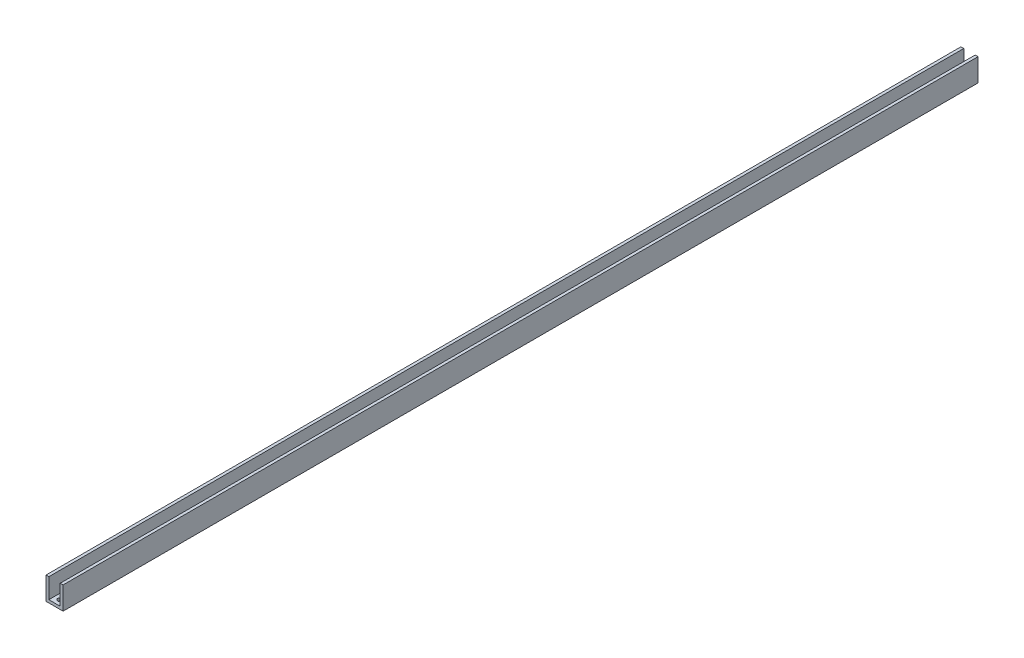
ISO-10303-21;
HEADER;
FILE_DESCRIPTION(('STEP AP214'),'2;1');
FILE_NAME('part.step','',(''),(''),'','','');
FILE_SCHEMA(('AUTOMOTIVE_DESIGN { 1 0 10303 214 1 1 1 1 }'));
ENDSEC;
DATA;
#1=APPLICATION_CONTEXT('core data for automotive mechanical design processes');
#2=APPLICATION_PROTOCOL_DEFINITION('international standard','automotive_design',2000,#1);
#3=PRODUCT_CONTEXT('',#1,'mechanical');
#4=PRODUCT('Part','Part','',(#3));
#5=PRODUCT_RELATED_PRODUCT_CATEGORY('part','',(#4));
#6=PRODUCT_DEFINITION_FORMATION('','',#4);
#7=PRODUCT_DEFINITION_CONTEXT('part definition',#1,'design');
#8=PRODUCT_DEFINITION('design','',#6,#7);
#9=PRODUCT_DEFINITION_SHAPE('','',#8);
#10=(LENGTH_UNIT() NAMED_UNIT(*) SI_UNIT(.MILLI.,.METRE.));
#11=(NAMED_UNIT(*) PLANE_ANGLE_UNIT() SI_UNIT($,.RADIAN.));
#12=(NAMED_UNIT(*) SI_UNIT($,.STERADIAN.) SOLID_ANGLE_UNIT());
#13=UNCERTAINTY_MEASURE_WITH_UNIT(LENGTH_MEASURE(1.E-05),#10,'distance_accuracy_value','');
#14=(GEOMETRIC_REPRESENTATION_CONTEXT(3) GLOBAL_UNCERTAINTY_ASSIGNED_CONTEXT((#13)) GLOBAL_UNIT_ASSIGNED_CONTEXT((#10,
#11,#12)) REPRESENTATION_CONTEXT('',''));
#15=CARTESIAN_POINT('',(0.,0.,0.));
#16=DIRECTION('',(0.,0.,1.));
#17=DIRECTION('',(1.,0.,0.));
#18=AXIS2_PLACEMENT_3D('',#15,#16,#17);
#19=CARTESIAN_POINT('',(9.525000000375,25.4000000003,510.));
#20=DIRECTION('',(3.1496021879254E-11,-1.,0.));
#21=DIRECTION('',(1.,3.1496021879254E-11,0.));
#22=AXIS2_PLACEMENT_3D('',#19,#20,#21);
#23=PLANE('',#22);
#24=DIRECTION('',(-1.,-3.1496021879254E-11,0.));
#25=VECTOR('',#24,1.);
#26=CARTESIAN_POINT('',(9.525000000375,25.4000000003,-510.));
#27=LINE('',#26,#25);
#28=CARTESIAN_POINT('',(9.525000000375,25.4000000003,-510.));
#29=VERTEX_POINT('',#28);
#30=CARTESIAN_POINT('',(6.3499999994375,25.4000000002,-510.));
#31=VERTEX_POINT('',#30);
#32=EDGE_CURVE('E180',#29,#31,#27,.T.);
#33=ORIENTED_EDGE('',*,*,#32,.T.);
#34=DIRECTION('',(0.,0.,-1.));
#35=VECTOR('',#34,1.);
#36=CARTESIAN_POINT('',(6.3499999994375,25.4000000002,510.));
#37=LINE('',#36,#35);
#38=CARTESIAN_POINT('',(6.3499999994375,25.4000000002,510.));
#39=VERTEX_POINT('',#38);
#40=EDGE_CURVE('E13',#39,#31,#37,.T.);
#41=ORIENTED_EDGE('',*,*,#40,.F.);
#42=DIRECTION('',(-1.,-3.1496021879254E-11,0.));
#43=VECTOR('',#42,1.);
#44=CARTESIAN_POINT('',(9.525000000375,25.4000000003,510.));
#45=LINE('',#44,#43);
#46=CARTESIAN_POINT('',(9.525000000375,25.4000000003,510.));
#47=VERTEX_POINT('',#46);
#48=EDGE_CURVE('E203',#47,#39,#45,.T.);
#49=ORIENTED_EDGE('',*,*,#48,.F.);
#50=DIRECTION('',(0.,0.,-1.));
#51=VECTOR('',#50,1.);
#52=CARTESIAN_POINT('',(9.525000000375,25.4000000003,510.));
#53=LINE('',#52,#51);
#54=EDGE_CURVE('E176',#47,#29,#53,.T.);
#55=ORIENTED_EDGE('',*,*,#54,.T.);
#56=EDGE_LOOP('',(#33,#41,#49,#55));
#57=FACE_BOUND('',#56,.T.);
#58=ADVANCED_FACE('F62',(#57),#23,.F.);
#59=CARTESIAN_POINT('',(6.3499999994375,25.4000000002,510.));
#60=DIRECTION('',(1.,1.6872907895327E-11,0.));
#61=DIRECTION('',(-1.6872907895327E-11,1.,0.));
#62=AXIS2_PLACEMENT_3D('',#59,#60,#61);
#63=PLANE('',#62);
#64=DIRECTION('',(1.6872907895327E-11,-1.,0.));
#65=VECTOR('',#64,1.);
#66=CARTESIAN_POINT('',(6.3499999994375,25.4000000002,-510.));
#67=LINE('',#66,#65);
#68=CARTESIAN_POINT('',(6.3499999998125,3.1750000002775,-510.));
#69=VERTEX_POINT('',#68);
#70=EDGE_CURVE('E184',#31,#69,#67,.T.);
#71=ORIENTED_EDGE('',*,*,#70,.T.);
#72=DIRECTION('',(0.,0.,-1.));
#73=VECTOR('',#72,1.);
#74=CARTESIAN_POINT('',(6.3499999998125,3.1750000002775,510.));
#75=LINE('',#74,#73);
#76=CARTESIAN_POINT('',(6.3499999998125,3.1750000002775,510.));
#77=VERTEX_POINT('',#76);
#78=EDGE_CURVE('E71',#77,#69,#75,.T.);
#79=ORIENTED_EDGE('',*,*,#78,.F.);
#80=DIRECTION('',(1.6872907895327E-11,-1.,0.));
#81=VECTOR('',#80,1.);
#82=CARTESIAN_POINT('',(6.3499999994375,25.4000000002,510.));
#83=LINE('',#82,#81);
#84=EDGE_CURVE('E134',#39,#77,#83,.T.);
#85=ORIENTED_EDGE('',*,*,#84,.F.);
#86=ORIENTED_EDGE('',*,*,#40,.T.);
#87=EDGE_LOOP('',(#71,#79,#85,#86));
#88=FACE_BOUND('',#87,.T.);
#89=ADVANCED_FACE('F293',(#88),#63,.F.);
#90=CARTESIAN_POINT('',(6.3499999998125,3.1750000002775,510.));
#91=DIRECTION('',(2.18504129928468E-11,-1.,0.));
#92=DIRECTION('',(1.,2.18504129928468E-11,0.));
#93=AXIS2_PLACEMENT_3D('',#90,#91,#92);
#94=PLANE('',#93);
#95=CARTESIAN_POINT('',(-3.10419892534837E-11,3.17500000013875,-490.95));
#96=DIRECTION('',(2.18504129928468E-11,-1.,0.));
#97=DIRECTION('',(1.,2.18504129928468E-11,0.));
#98=AXIS2_PLACEMENT_3D('',#95,#96,#97);
#99=CIRCLE('',#98,2.74999999999999);
#100=CARTESIAN_POINT('',(2.74999999996895,3.17500000019884,-490.95));
#101=VERTEX_POINT('',#100);
#102=EDGE_CURVE('E272',#101,#101,#99,.F.);
#103=ORIENTED_EDGE('',*,*,#102,.F.);
#104=EDGE_LOOP('',(#103));
#105=FACE_BOUND('',#104,.T.);
#106=CARTESIAN_POINT('',(-3.10435445549186E-11,3.17500000013875,-503.65));
#107=DIRECTION('',(2.18504129928468E-11,-1.,0.));
#108=DIRECTION('',(1.,2.18504129928468E-11,0.));
#109=AXIS2_PLACEMENT_3D('',#106,#107,#108);
#110=CIRCLE('',#109,2.74999999999998);
#111=CARTESIAN_POINT('',(2.74999999996894,3.17500000019884,-503.65));
#112=VERTEX_POINT('',#111);
#113=EDGE_CURVE('E264',#112,#112,#110,.F.);
#114=ORIENTED_EDGE('',*,*,#113,.F.);
#115=EDGE_LOOP('',(#114));
#116=FACE_BOUND('',#115,.T.);
#117=CARTESIAN_POINT('',(-3.10419892534837E-11,3.17500000013875,490.95));
#118=DIRECTION('',(2.18504129928468E-11,-1.,0.));
#119=DIRECTION('',(1.,2.18504129928468E-11,0.));
#120=AXIS2_PLACEMENT_3D('',#117,#118,#119);
#121=CIRCLE('',#120,2.74999999999999);
#122=CARTESIAN_POINT('',(2.74999999996895,3.17500000019884,490.95));
#123=VERTEX_POINT('',#122);
#124=EDGE_CURVE('E256',#123,#123,#121,.T.);
#125=ORIENTED_EDGE('',*,*,#124,.T.);
#126=EDGE_LOOP('',(#125));
#127=FACE_BOUND('',#126,.T.);
#128=CARTESIAN_POINT('',(-3.10435445549186E-11,3.17500000013875,503.65));
#129=DIRECTION('',(2.18504129928468E-11,-1.,0.));
#130=DIRECTION('',(1.,2.18504129928468E-11,0.));
#131=AXIS2_PLACEMENT_3D('',#128,#129,#130);
#132=CIRCLE('',#131,2.74999999999998);
#133=CARTESIAN_POINT('',(2.74999999996894,3.17500000019884,503.65));
#134=VERTEX_POINT('',#133);
#135=EDGE_CURVE('E185',#134,#134,#132,.T.);
#136=ORIENTED_EDGE('',*,*,#135,.T.);
#137=EDGE_LOOP('',(#136));
#138=FACE_BOUND('',#137,.T.);
#139=DIRECTION('',(-1.,-2.18504129928468E-11,0.));
#140=VECTOR('',#139,1.);
#141=CARTESIAN_POINT('',(6.3499999998125,3.1750000002775,-510.));
#142=LINE('',#141,#140);
#143=CARTESIAN_POINT('',(-6.35,3.175,-510.));
#144=VERTEX_POINT('',#143);
#145=EDGE_CURVE('E188',#69,#144,#142,.T.);
#146=ORIENTED_EDGE('',*,*,#145,.T.);
#147=DIRECTION('',(0.,0.,-1.));
#148=VECTOR('',#147,1.);
#149=CARTESIAN_POINT('',(-6.35,3.175,510.));
#150=LINE('',#149,#148);
#151=CARTESIAN_POINT('',(-6.35,3.175,510.));
#152=VERTEX_POINT('',#151);
#153=EDGE_CURVE('E214',#152,#144,#150,.T.);
#154=ORIENTED_EDGE('',*,*,#153,.F.);
#155=DIRECTION('',(-1.,-2.18504129928468E-11,0.));
#156=VECTOR('',#155,1.);
#157=CARTESIAN_POINT('',(6.3499999998125,3.1750000002775,510.));
#158=LINE('',#157,#156);
#159=EDGE_CURVE('E226',#77,#152,#158,.T.);
#160=ORIENTED_EDGE('',*,*,#159,.F.);
#161=ORIENTED_EDGE('',*,*,#78,.T.);
#162=EDGE_LOOP('',(#146,#154,#160,#161));
#163=FACE_BOUND('',#162,.T.);
#164=ADVANCED_FACE('F224',(#105,#116,#127,#138,#163),#94,.F.);
#165=CARTESIAN_POINT('',(-6.35,3.175,510.));
#166=DIRECTION('',(-1.,0.,0.));
#167=DIRECTION('',(0.,0.,1.));
#168=AXIS2_PLACEMENT_3D('',#165,#166,#167);
#169=PLANE('',#168);
#170=DIRECTION('',(0.,1.,0.));
#171=VECTOR('',#170,1.);
#172=CARTESIAN_POINT('',(-6.35,3.175,-510.));
#173=LINE('',#172,#171);
#174=CARTESIAN_POINT('',(-6.35,25.3999999996,-510.));
#175=VERTEX_POINT('',#174);
#176=EDGE_CURVE('E191',#144,#175,#173,.T.);
#177=ORIENTED_EDGE('',*,*,#176,.T.);
#178=DIRECTION('',(0.,0.,-1.));
#179=VECTOR('',#178,1.);
#180=CARTESIAN_POINT('',(-6.35,25.3999999996,510.));
#181=LINE('',#180,#179);
#182=CARTESIAN_POINT('',(-6.35,25.3999999996,510.));
#183=VERTEX_POINT('',#182);
#184=EDGE_CURVE('E210',#183,#175,#181,.T.);
#185=ORIENTED_EDGE('',*,*,#184,.F.);
#186=DIRECTION('',(0.,1.,0.));
#187=VECTOR('',#186,1.);
#188=CARTESIAN_POINT('',(-6.35,3.175,510.));
#189=LINE('',#188,#187);
#190=EDGE_CURVE('E238',#152,#183,#189,.T.);
#191=ORIENTED_EDGE('',*,*,#190,.F.);
#192=ORIENTED_EDGE('',*,*,#153,.T.);
#193=EDGE_LOOP('',(#177,#185,#191,#192));
#194=FACE_BOUND('',#193,.T.);
#195=ADVANCED_FACE('F234',(#194),#169,.F.);
#196=CARTESIAN_POINT('',(-6.35,25.3999999996,510.));
#197=DIRECTION('',(-9.4488065648922E-11,-1.,0.));
#198=DIRECTION('',(1.,-9.4488065648922E-11,0.));
#199=AXIS2_PLACEMENT_3D('',#196,#197,#198);
#200=PLANE('',#199);
#201=DIRECTION('',(-1.,9.4488065648922E-11,0.));
#202=VECTOR('',#201,1.);
#203=CARTESIAN_POINT('',(-6.35,25.3999999996,-510.));
#204=LINE('',#203,#202);
#205=CARTESIAN_POINT('',(-9.5250000005625,25.3999999999,-510.));
#206=VERTEX_POINT('',#205);
#207=EDGE_CURVE('E194',#175,#206,#204,.T.);
#208=ORIENTED_EDGE('',*,*,#207,.T.);
#209=DIRECTION('',(0.,0.,-1.));
#210=VECTOR('',#209,1.);
#211=CARTESIAN_POINT('',(-9.5250000005625,25.3999999999,510.));
#212=LINE('',#211,#210);
#213=CARTESIAN_POINT('',(-9.5250000005625,25.3999999999,510.));
#214=VERTEX_POINT('',#213);
#215=EDGE_CURVE('E168',#214,#206,#212,.T.);
#216=ORIENTED_EDGE('',*,*,#215,.F.);
#217=DIRECTION('',(-1.,9.4488065648922E-11,0.));
#218=VECTOR('',#217,1.);
#219=CARTESIAN_POINT('',(-6.35,25.3999999996,510.));
#220=LINE('',#219,#218);
#221=EDGE_CURVE('E157',#183,#214,#220,.T.);
#222=ORIENTED_EDGE('',*,*,#221,.F.);
#223=ORIENTED_EDGE('',*,*,#184,.T.);
#224=EDGE_LOOP('',(#208,#216,#222,#223));
#225=FACE_BOUND('',#224,.T.);
#226=ADVANCED_FACE('F237',(#225),#200,.F.);
#227=CARTESIAN_POINT('',(-9.5250000005625,25.3999999999,510.));
#228=DIRECTION('',(1.,1.47637261120555E-11,0.));
#229=DIRECTION('',(-1.47637261120555E-11,1.,0.));
#230=AXIS2_PLACEMENT_3D('',#227,#228,#229);
#231=PLANE('',#230);
#232=DIRECTION('',(1.47637261120555E-11,-1.,0.));
#233=VECTOR('',#232,1.);
#234=CARTESIAN_POINT('',(-9.5250000005625,25.3999999999,-510.));
#235=LINE('',#234,#233);
#236=CARTESIAN_POINT('',(-9.5250000001875,-2.79398899849514E-10,-510.));
#237=VERTEX_POINT('',#236);
#238=EDGE_CURVE('E166',#206,#237,#235,.T.);
#239=ORIENTED_EDGE('',*,*,#238,.T.);
#240=DIRECTION('',(0.,0.,-1.));
#241=VECTOR('',#240,1.);
#242=CARTESIAN_POINT('',(-9.5250000001875,-2.79398899849514E-10,510.));
#243=LINE('',#242,#241);
#244=CARTESIAN_POINT('',(-9.5250000001875,-2.79398899849514E-10,510.));
#245=VERTEX_POINT('',#244);
#246=EDGE_CURVE('E163',#245,#237,#243,.T.);
#247=ORIENTED_EDGE('',*,*,#246,.F.);
#248=DIRECTION('',(1.47637261120555E-11,-1.,0.));
#249=VECTOR('',#248,1.);
#250=CARTESIAN_POINT('',(-9.5250000005625,25.3999999999,510.));
#251=LINE('',#250,#249);
#252=EDGE_CURVE('E151',#214,#245,#251,.T.);
#253=ORIENTED_EDGE('',*,*,#252,.F.);
#254=ORIENTED_EDGE('',*,*,#215,.T.);
#255=EDGE_LOOP('',(#239,#247,#253,#254));
#256=FACE_BOUND('',#255,.T.);
#257=ADVANCED_FACE('F164',(#256),#231,.F.);
#258=CARTESIAN_POINT('',(-9.5250000001875,-2.79398899849514E-10,510.));
#259=DIRECTION('',(-9.77773927693839E-12,1.,0.));
#260=DIRECTION('',(-1.,-9.77773927693839E-12,0.));
#261=AXIS2_PLACEMENT_3D('',#258,#259,#260);
#262=PLANE('',#261);
#263=CARTESIAN_POINT('',(0.,0.,-490.95));
#264=DIRECTION('',(-9.77773927693839E-12,1.,0.));
#265=DIRECTION('',(1.,9.77773927693839E-12,0.));
#266=AXIS2_PLACEMENT_3D('',#263,#264,#265);
#267=CIRCLE('',#266,2.74999999999999);
#268=CARTESIAN_POINT('',(2.74999999999999,2.68887830115805E-11,-490.95));
#269=VERTEX_POINT('',#268);
#270=EDGE_CURVE('E276',#269,#269,#267,.T.);
#271=ORIENTED_EDGE('',*,*,#270,.T.);
#272=EDGE_LOOP('',(#271));
#273=FACE_BOUND('',#272,.T.);
#274=CARTESIAN_POINT('',(0.,0.,-503.65));
#275=DIRECTION('',(-9.77773927693839E-12,1.,0.));
#276=DIRECTION('',(1.,9.77773927693839E-12,0.));
#277=AXIS2_PLACEMENT_3D('',#274,#275,#276);
#278=CIRCLE('',#277,2.74999999999998);
#279=CARTESIAN_POINT('',(2.74999999999999,2.68887830115804E-11,-503.65));
#280=VERTEX_POINT('',#279);
#281=EDGE_CURVE('E268',#280,#280,#278,.T.);
#282=ORIENTED_EDGE('',*,*,#281,.T.);
#283=EDGE_LOOP('',(#282));
#284=FACE_BOUND('',#283,.T.);
#285=CARTESIAN_POINT('',(0.,0.,490.95));
#286=DIRECTION('',(9.77773927693839E-12,-1.,0.));
#287=DIRECTION('',(1.,9.77773927693839E-12,0.));
#288=AXIS2_PLACEMENT_3D('',#285,#286,#287);
#289=CIRCLE('',#288,2.74999999999999);
#290=CARTESIAN_POINT('',(2.74999999999999,2.68887830115805E-11,490.95));
#291=VERTEX_POINT('',#290);
#292=EDGE_CURVE('E260',#291,#291,#289,.T.);
#293=ORIENTED_EDGE('',*,*,#292,.F.);
#294=EDGE_LOOP('',(#293));
#295=FACE_BOUND('',#294,.T.);
#296=CARTESIAN_POINT('',(0.,0.,503.65));
#297=DIRECTION('',(9.77773927693839E-12,-1.,0.));
#298=DIRECTION('',(1.,9.77773927693839E-12,0.));
#299=AXIS2_PLACEMENT_3D('',#296,#297,#298);
#300=CIRCLE('',#299,2.74999999999998);
#301=CARTESIAN_POINT('',(2.74999999999999,2.68887830115804E-11,503.65));
#302=VERTEX_POINT('',#301);
#303=EDGE_CURVE('E252',#302,#302,#300,.T.);
#304=ORIENTED_EDGE('',*,*,#303,.F.);
#305=EDGE_LOOP('',(#304));
#306=FACE_BOUND('',#305,.T.);
#307=DIRECTION('',(1.,9.77773927693839E-12,0.));
#308=VECTOR('',#307,1.);
#309=CARTESIAN_POINT('',(-9.5250000001875,-2.79398899849514E-10,-510.));
#310=LINE('',#309,#308);
#311=CARTESIAN_POINT('',(9.5250000005625,-9.31329666165048E-11,-510.));
#312=VERTEX_POINT('',#311);
#313=EDGE_CURVE('E118',#237,#312,#310,.T.);
#314=ORIENTED_EDGE('',*,*,#313,.T.);
#315=DIRECTION('',(0.,0.,-1.));
#316=VECTOR('',#315,1.);
#317=CARTESIAN_POINT('',(9.5250000005625,-9.31329666165048E-11,510.));
#318=LINE('',#317,#316);
#319=CARTESIAN_POINT('',(9.5250000005625,-9.31329666165048E-11,510.));
#320=VERTEX_POINT('',#319);
#321=EDGE_CURVE('E169',#320,#312,#318,.T.);
#322=ORIENTED_EDGE('',*,*,#321,.F.);
#323=DIRECTION('',(1.,9.77773927693839E-12,0.));
#324=VECTOR('',#323,1.);
#325=CARTESIAN_POINT('',(-9.5250000001875,-2.79398899849514E-10,510.));
#326=LINE('',#325,#324);
#327=EDGE_CURVE('E155',#245,#320,#326,.T.);
#328=ORIENTED_EDGE('',*,*,#327,.F.);
#329=ORIENTED_EDGE('',*,*,#246,.T.);
#330=EDGE_LOOP('',(#314,#322,#328,#329));
#331=FACE_BOUND('',#330,.T.);
#332=ADVANCED_FACE('F171',(#273,#284,#295,#306,#331),#262,.F.);
#333=CARTESIAN_POINT('',(9.5250000005625,-9.31329666165048E-11,510.));
#334=DIRECTION('',(-1.,-7.38193135216548E-12,0.));
#335=DIRECTION('',(7.38193135216548E-12,-1.,0.));
#336=AXIS2_PLACEMENT_3D('',#333,#334,#335);
#337=PLANE('',#336);
#338=DIRECTION('',(-7.38193135216548E-12,1.,0.));
#339=VECTOR('',#338,1.);
#340=CARTESIAN_POINT('',(9.5250000005625,-9.31329666165048E-11,-510.));
#341=LINE('',#340,#339);
#342=EDGE_CURVE('E125',#312,#29,#341,.T.);
#343=ORIENTED_EDGE('',*,*,#342,.T.);
#344=ORIENTED_EDGE('',*,*,#54,.F.);
#345=DIRECTION('',(-7.38193135216548E-12,1.,0.));
#346=VECTOR('',#345,1.);
#347=CARTESIAN_POINT('',(9.5250000005625,-9.31329666165048E-11,510.));
#348=LINE('',#347,#346);
#349=EDGE_CURVE('E81',#320,#47,#348,.T.);
#350=ORIENTED_EDGE('',*,*,#349,.F.);
#351=ORIENTED_EDGE('',*,*,#321,.T.);
#352=EDGE_LOOP('',(#343,#344,#350,#351));
#353=FACE_BOUND('',#352,.T.);
#354=ADVANCED_FACE('F321',(#353),#337,.F.);
#355=CARTESIAN_POINT('',(0.,0.,510.));
#356=DIRECTION('',(0.,0.,1.));
#357=DIRECTION('',(1.,0.,0.));
#358=AXIS2_PLACEMENT_3D('',#355,#356,#357);
#359=PLANE('',#358);
#360=ORIENTED_EDGE('',*,*,#48,.T.);
#361=ORIENTED_EDGE('',*,*,#84,.T.);
#362=ORIENTED_EDGE('',*,*,#159,.T.);
#363=ORIENTED_EDGE('',*,*,#190,.T.);
#364=ORIENTED_EDGE('',*,*,#221,.T.);
#365=ORIENTED_EDGE('',*,*,#252,.T.);
#366=ORIENTED_EDGE('',*,*,#327,.T.);
#367=ORIENTED_EDGE('',*,*,#349,.T.);
#368=EDGE_LOOP('',(#360,#361,#362,#363,#364,#365,#366,#367));
#369=FACE_BOUND('',#368,.T.);
#370=ADVANCED_FACE('F153',(#369),#359,.T.);
#371=CARTESIAN_POINT('',(0.,0.,-510.));
#372=DIRECTION('',(0.,0.,1.));
#373=DIRECTION('',(1.,0.,0.));
#374=AXIS2_PLACEMENT_3D('',#371,#372,#373);
#375=PLANE('',#374);
#376=ORIENTED_EDGE('',*,*,#32,.F.);
#377=ORIENTED_EDGE('',*,*,#342,.F.);
#378=ORIENTED_EDGE('',*,*,#313,.F.);
#379=ORIENTED_EDGE('',*,*,#238,.F.);
#380=ORIENTED_EDGE('',*,*,#207,.F.);
#381=ORIENTED_EDGE('',*,*,#176,.F.);
#382=ORIENTED_EDGE('',*,*,#145,.F.);
#383=ORIENTED_EDGE('',*,*,#70,.F.);
#384=EDGE_LOOP('',(#376,#377,#378,#379,#380,#381,#382,#383));
#385=FACE_BOUND('',#384,.T.);
#386=ADVANCED_FACE('F230',(#385),#375,.F.);
#387=CARTESIAN_POINT('',(-2.48353799987362E-10,25.4000000003931,503.65));
#388=DIRECTION('',(9.77773927693839E-12,-1.,0.));
#389=DIRECTION('',(1.,9.77773927693839E-12,0.));
#390=AXIS2_PLACEMENT_3D('',#387,#388,#389);
#391=CYLINDRICAL_SURFACE('',#390,2.74999999999998);
#392=ORIENTED_EDGE('',*,*,#303,.T.);
#393=EDGE_LOOP('',(#392));
#394=FACE_BOUND('',#393,.T.);
#395=ORIENTED_EDGE('',*,*,#135,.F.);
#396=EDGE_LOOP('',(#395));
#397=FACE_BOUND('',#396,.T.);
#398=ADVANCED_FACE('F301',(#394,#397),#391,.F.);
#399=CARTESIAN_POINT('',(-2.48352244685927E-10,25.4000000003931,490.95));
#400=DIRECTION('',(9.77773927693839E-12,-1.,0.));
#401=DIRECTION('',(1.,9.77773927693839E-12,0.));
#402=AXIS2_PLACEMENT_3D('',#399,#400,#401);
#403=CYLINDRICAL_SURFACE('',#402,2.74999999999999);
#404=ORIENTED_EDGE('',*,*,#292,.T.);
#405=EDGE_LOOP('',(#404));
#406=FACE_BOUND('',#405,.T.);
#407=ORIENTED_EDGE('',*,*,#124,.F.);
#408=EDGE_LOOP('',(#407));
#409=FACE_BOUND('',#408,.T.);
#410=ADVANCED_FACE('F303',(#406,#409),#403,.F.);
#411=CARTESIAN_POINT('',(-2.48353799987362E-10,25.4000000003931,-503.65));
#412=DIRECTION('',(9.77773927693839E-12,-1.,0.));
#413=DIRECTION('',(1.,9.77773927693839E-12,0.));
#414=AXIS2_PLACEMENT_3D('',#411,#412,#413);
#415=CYLINDRICAL_SURFACE('',#414,2.74999999999998);
#416=ORIENTED_EDGE('',*,*,#281,.F.);
#417=EDGE_LOOP('',(#416));
#418=FACE_BOUND('',#417,.T.);
#419=ORIENTED_EDGE('',*,*,#113,.T.);
#420=EDGE_LOOP('',(#419));
#421=FACE_BOUND('',#420,.T.);
#422=ADVANCED_FACE('F287',(#418,#421),#415,.F.);
#423=CARTESIAN_POINT('',(-2.48352244685927E-10,25.4000000003931,-490.95));
#424=DIRECTION('',(9.77773927693839E-12,-1.,0.));
#425=DIRECTION('',(1.,9.77773927693839E-12,0.));
#426=AXIS2_PLACEMENT_3D('',#423,#424,#425);
#427=CYLINDRICAL_SURFACE('',#426,2.74999999999999);
#428=ORIENTED_EDGE('',*,*,#270,.F.);
#429=EDGE_LOOP('',(#428));
#430=FACE_BOUND('',#429,.T.);
#431=ORIENTED_EDGE('',*,*,#102,.T.);
#432=EDGE_LOOP('',(#431));
#433=FACE_BOUND('',#432,.T.);
#434=ADVANCED_FACE('F284',(#430,#433),#427,.F.);
#435=CLOSED_SHELL('',(#58,#89,#164,#195,#226,#257,#332,#354,#370,#386,#398,#410,#422,#434));
#436=MANIFOLD_SOLID_BREP('B2',#435);
#437=CARTESIAN_POINT('',(0.,0.,-246.0625));
#438=DIRECTION('',(0.,-1.,0.));
#439=DIRECTION('',(0.,0.,-1.));
#440=AXIS2_PLACEMENT_3D('',#437,#438,#439);
#441=CYLINDRICAL_SURFACE('',#440,2.75);
#442=CARTESIAN_POINT('',(0.,3.175,-246.0625));
#443=DIRECTION('',(0.,-1.,0.));
#444=DIRECTION('',(0.,0.,-1.));
#445=AXIS2_PLACEMENT_3D('',#442,#443,#444);
#446=CIRCLE('',#445,2.75);
#447=CARTESIAN_POINT('',(0.,3.175,-248.8125));
#448=VERTEX_POINT('',#447);
#449=EDGE_CURVE('E622',#448,#448,#446,.F.);
#450=ORIENTED_EDGE('',*,*,#449,.T.);
#451=EDGE_LOOP('',(#450));
#452=FACE_BOUND('',#451,.T.);
#453=CARTESIAN_POINT('',(0.,2.45000000001028,-246.0625));
#454=DIRECTION('',(0.,-1.,0.));
#455=DIRECTION('',(0.,0.,-1.));
#456=AXIS2_PLACEMENT_3D('',#453,#454,#455);
#457=CIRCLE('',#456,2.74999999998543);
#458=CARTESIAN_POINT('',(0.,2.45000000001028,-248.812499999985));
#459=VERTEX_POINT('',#458);
#460=EDGE_CURVE('E703',#459,#459,#457,.T.);
#461=ORIENTED_EDGE('',*,*,#460,.T.);
#462=EDGE_LOOP('',(#461));
#463=FACE_BOUND('',#462,.T.);
#464=ADVANCED_FACE('F478',(#452,#463),#441,.F.);
#465=CARTESIAN_POINT('',(0.,0.,-233.3625));
#466=DIRECTION('',(0.,-1.,0.));
#467=DIRECTION('',(0.,0.,-1.));
#468=AXIS2_PLACEMENT_3D('',#465,#466,#467);
#469=CYLINDRICAL_SURFACE('',#468,2.75);
#470=CARTESIAN_POINT('',(0.,3.175,-233.3625));
#471=DIRECTION('',(0.,-1.,0.));
#472=DIRECTION('',(0.,0.,-1.));
#473=AXIS2_PLACEMENT_3D('',#470,#471,#472);
#474=CIRCLE('',#473,2.75);
#475=CARTESIAN_POINT('',(0.,3.175,-236.1125));
#476=VERTEX_POINT('',#475);
#477=EDGE_CURVE('E614',#476,#476,#474,.F.);
#478=ORIENTED_EDGE('',*,*,#477,.T.);
#479=EDGE_LOOP('',(#478));
#480=FACE_BOUND('',#479,.T.);
#481=CARTESIAN_POINT('',(0.,2.45000000001028,-233.3625));
#482=DIRECTION('',(0.,-1.,0.));
#483=DIRECTION('',(0.,0.,-1.));
#484=AXIS2_PLACEMENT_3D('',#481,#482,#483);
#485=CIRCLE('',#484,2.74999999999015);
#486=CARTESIAN_POINT('',(0.,2.45000000001028,-236.11249999999));
#487=VERTEX_POINT('',#486);
#488=EDGE_CURVE('E611',#487,#487,#485,.T.);
#489=ORIENTED_EDGE('',*,*,#488,.T.);
#490=EDGE_LOOP('',(#489));
#491=FACE_BOUND('',#490,.T.);
#492=ADVANCED_FACE('F807',(#480,#491),#469,.F.);
#493=CARTESIAN_POINT('',(0.,0.,381.805973729502));
#494=DIRECTION('',(0.,-1.,0.));
#495=DIRECTION('',(0.,0.,-1.));
#496=AXIS2_PLACEMENT_3D('',#493,#494,#495);
#497=CYLINDRICAL_SURFACE('',#496,2.75);
#498=CARTESIAN_POINT('',(0.,3.175,381.805973729502));
#499=DIRECTION('',(0.,-1.,0.));
#500=DIRECTION('',(0.,0.,-1.));
#501=AXIS2_PLACEMENT_3D('',#498,#499,#500);
#502=CIRCLE('',#501,2.75);
#503=CARTESIAN_POINT('',(0.,3.175,379.055973729502));
#504=VERTEX_POINT('',#503);
#505=EDGE_CURVE('E608',#504,#504,#502,.F.);
#506=ORIENTED_EDGE('',*,*,#505,.T.);
#507=EDGE_LOOP('',(#506));
#508=FACE_BOUND('',#507,.T.);
#509=CARTESIAN_POINT('',(0.,2.44999999995343,381.805973729502));
#510=DIRECTION('',(0.,-1.,0.));
#511=DIRECTION('',(0.,0.,-1.));
#512=AXIS2_PLACEMENT_3D('',#509,#510,#511);
#513=CIRCLE('',#512,2.75000000005032);
#514=CARTESIAN_POINT('',(0.,2.44999999995343,379.055973729452));
#515=VERTEX_POINT('',#514);
#516=EDGE_CURVE('E603',#515,#515,#513,.T.);
#517=ORIENTED_EDGE('',*,*,#516,.T.);
#518=EDGE_LOOP('',(#517));
#519=FACE_BOUND('',#518,.T.);
#520=ADVANCED_FACE('F810',(#508,#519),#497,.F.);
#521=CARTESIAN_POINT('',(0.,0.,394.505973729502));
#522=DIRECTION('',(0.,-1.,0.));
#523=DIRECTION('',(0.,0.,-1.));
#524=AXIS2_PLACEMENT_3D('',#521,#522,#523);
#525=CYLINDRICAL_SURFACE('',#524,2.75);
#526=CARTESIAN_POINT('',(0.,3.175,394.505973729502));
#527=DIRECTION('',(0.,-1.,0.));
#528=DIRECTION('',(0.,0.,-1.));
#529=AXIS2_PLACEMENT_3D('',#526,#527,#528);
#530=CIRCLE('',#529,2.75);
#531=CARTESIAN_POINT('',(0.,3.175,391.755973729502));
#532=VERTEX_POINT('',#531);
#533=EDGE_CURVE('E569',#532,#532,#530,.F.);
#534=ORIENTED_EDGE('',*,*,#533,.T.);
#535=EDGE_LOOP('',(#534));
#536=FACE_BOUND('',#535,.T.);
#537=CARTESIAN_POINT('',(0.,2.44999999995343,394.505973729502));
#538=DIRECTION('',(0.,-1.,0.));
#539=DIRECTION('',(0.,0.,-1.));
#540=AXIS2_PLACEMENT_3D('',#537,#538,#539);
#541=CIRCLE('',#540,2.75000000005504);
#542=CARTESIAN_POINT('',(0.,2.44999999995343,391.755973729447));
#543=VERTEX_POINT('',#542);
#544=EDGE_CURVE('E599',#543,#543,#541,.T.);
#545=ORIENTED_EDGE('',*,*,#544,.T.);
#546=EDGE_LOOP('',(#545));
#547=FACE_BOUND('',#546,.T.);
#548=ADVANCED_FACE('F805',(#536,#547),#525,.F.);
#549=CARTESIAN_POINT('',(0.,-5.6843418860808E-11,-246.0625));
#550=DIRECTION('',(0.,-1.,0.));
#551=DIRECTION('',(0.,0.,-1.));
#552=AXIS2_PLACEMENT_3D('',#549,#550,#551);
#553=CONICAL_SURFACE('',#552,5.19999999999571,0.785398163385848);
#554=ORIENTED_EDGE('',*,*,#460,.F.);
#555=EDGE_LOOP('',(#554));
#556=FACE_BOUND('',#555,.T.);
#557=CARTESIAN_POINT('',(0.,-5.6843418860808E-11,-246.0625));
#558=DIRECTION('',(0.,-1.,0.));
#559=DIRECTION('',(0.,0.,-1.));
#560=AXIS2_PLACEMENT_3D('',#557,#558,#559);
#561=CIRCLE('',#560,5.19999999999571);
#562=CARTESIAN_POINT('',(0.,-5.6843418860808E-11,-251.262499999996));
#563=VERTEX_POINT('',#562);
#564=EDGE_CURVE('E633',#563,#563,#561,.T.);
#565=ORIENTED_EDGE('',*,*,#564,.T.);
#566=EDGE_LOOP('',(#565));
#567=FACE_BOUND('',#566,.T.);
#568=ADVANCED_FACE('F721',(#556,#567),#553,.F.);
#569=CARTESIAN_POINT('',(0.,-5.6843418860808E-11,-233.3625));
#570=DIRECTION('',(0.,-1.,0.));
#571=DIRECTION('',(0.,0.,-1.));
#572=AXIS2_PLACEMENT_3D('',#569,#570,#571);
#573=CONICAL_SURFACE('',#572,5.20000000000043,0.785398163385848);
#574=ORIENTED_EDGE('',*,*,#488,.F.);
#575=EDGE_LOOP('',(#574));
#576=FACE_BOUND('',#575,.T.);
#577=CARTESIAN_POINT('',(0.,-5.6843418860808E-11,-233.3625));
#578=DIRECTION('',(0.,-1.,0.));
#579=DIRECTION('',(0.,0.,-1.));
#580=AXIS2_PLACEMENT_3D('',#577,#578,#579);
#581=CIRCLE('',#580,5.20000000000043);
#582=CARTESIAN_POINT('',(0.,-5.6843418860808E-11,-238.5625));
#583=VERTEX_POINT('',#582);
#584=EDGE_CURVE('E710',#583,#583,#581,.T.);
#585=ORIENTED_EDGE('',*,*,#584,.T.);
#586=EDGE_LOOP('',(#585));
#587=FACE_BOUND('',#586,.T.);
#588=ADVANCED_FACE('F799',(#576,#587),#573,.F.);
#589=CARTESIAN_POINT('',(0.,0.,381.805973729502));
#590=DIRECTION('',(0.,-1.,0.));
#591=DIRECTION('',(0.,0.,-1.));
#592=AXIS2_PLACEMENT_3D('',#589,#590,#591);
#593=CONICAL_SURFACE('',#592,5.20000000000376,0.785398163397448);
#594=ORIENTED_EDGE('',*,*,#516,.F.);
#595=EDGE_LOOP('',(#594));
#596=FACE_BOUND('',#595,.T.);
#597=CARTESIAN_POINT('',(0.,0.,381.805973729502));
#598=DIRECTION('',(0.,-1.,0.));
#599=DIRECTION('',(0.,0.,-1.));
#600=AXIS2_PLACEMENT_3D('',#597,#598,#599);
#601=CIRCLE('',#600,5.20000000000376);
#602=CARTESIAN_POINT('',(0.,0.,376.605973729498));
#603=VERTEX_POINT('',#602);
#604=EDGE_CURVE('E482',#603,#603,#601,.T.);
#605=ORIENTED_EDGE('',*,*,#604,.T.);
#606=EDGE_LOOP('',(#605));
#607=FACE_BOUND('',#606,.T.);
#608=ADVANCED_FACE('F480',(#596,#607),#593,.F.);
#609=CARTESIAN_POINT('',(0.,0.,394.505973729502));
#610=DIRECTION('',(0.,-1.,0.));
#611=DIRECTION('',(0.,0.,-1.));
#612=AXIS2_PLACEMENT_3D('',#609,#610,#611);
#613=CONICAL_SURFACE('',#612,5.20000000000848,0.785398163397448);
#614=ORIENTED_EDGE('',*,*,#544,.F.);
#615=EDGE_LOOP('',(#614));
#616=FACE_BOUND('',#615,.T.);
#617=CARTESIAN_POINT('',(0.,0.,394.505973729502));
#618=DIRECTION('',(0.,-1.,0.));
#619=DIRECTION('',(0.,0.,-1.));
#620=AXIS2_PLACEMENT_3D('',#617,#618,#619);
#621=CIRCLE('',#620,5.20000000000848);
#622=CARTESIAN_POINT('',(0.,0.,389.305973729494));
#623=VERTEX_POINT('',#622);
#624=EDGE_CURVE('E587',#623,#623,#621,.T.);
#625=ORIENTED_EDGE('',*,*,#624,.T.);
#626=EDGE_LOOP('',(#625));
#627=FACE_BOUND('',#626,.T.);
#628=ADVANCED_FACE('F798',(#616,#627),#613,.F.);
#629=CARTESIAN_POINT('',(9.525,25.4,252.4125));
#630=DIRECTION('',(0.,-1.,0.));
#631=DIRECTION('',(0.,0.,-1.));
#632=AXIS2_PLACEMENT_3D('',#629,#630,#631);
#633=PLANE('',#632);
#634=DIRECTION('',(0.,0.,-1.));
#635=VECTOR('',#634,1.);
#636=CARTESIAN_POINT('',(-9.525,25.4,252.4125));
#637=LINE('',#636,#635);
#638=CARTESIAN_POINT('',(-9.5250000005625,25.3999999999,-252.41249999925));
#639=VERTEX_POINT('',#638);
#640=CARTESIAN_POINT('',(-9.5250000005625,25.3999999999,427.77069130052));
#641=VERTEX_POINT('',#640);
#642=EDGE_CURVE('E602',#639,#641,#637,.F.);
#643=ORIENTED_EDGE('',*,*,#642,.T.);
#644=DIRECTION('',(1.,0.,0.));
#645=VECTOR('',#644,1.);
#646=CARTESIAN_POINT('',(-6.35,25.3999999996,427.77069130052));
#647=LINE('',#646,#645);
#648=CARTESIAN_POINT('',(-6.35,25.3999999996,427.77069130052));
#649=VERTEX_POINT('',#648);
#650=EDGE_CURVE('E586',#649,#641,#647,.F.);
#651=ORIENTED_EDGE('',*,*,#650,.F.);
#652=DIRECTION('',(0.,0.,1.));
#653=VECTOR('',#652,1.);
#654=CARTESIAN_POINT('',(-6.35,25.3999999996,252.4125));
#655=LINE('',#654,#653);
#656=CARTESIAN_POINT('',(-6.35,25.3999999998,-252.41249999925));
#657=VERTEX_POINT('',#656);
#658=EDGE_CURVE('E568',#649,#657,#655,.F.);
#659=ORIENTED_EDGE('',*,*,#658,.T.);
#660=DIRECTION('',(1.,0.,0.));
#661=VECTOR('',#660,1.);
#662=CARTESIAN_POINT('',(-6.35,25.3999999996,-252.4125));
#663=LINE('',#662,#661);
#664=EDGE_CURVE('E689',#657,#639,#663,.F.);
#665=ORIENTED_EDGE('',*,*,#664,.T.);
#666=EDGE_LOOP('',(#643,#651,#659,#665));
#667=FACE_BOUND('',#666,.T.);
#668=ADVANCED_FACE('F783',(#667),#633,.F.);
#669=CARTESIAN_POINT('',(-9.525,25.4,252.4125));
#670=DIRECTION('',(1.,0.,0.));
#671=DIRECTION('',(0.,0.,-1.));
#672=AXIS2_PLACEMENT_3D('',#669,#670,#671);
#673=PLANE('',#672);
#674=DIRECTION('',(0.,0.,1.));
#675=VECTOR('',#674,1.);
#676=CARTESIAN_POINT('',(-9.525,0.,252.4125));
#677=LINE('',#676,#675);
#678=CARTESIAN_POINT('',(-9.5250000001875,-2.79398899849514E-10,-252.41249999925));
#679=VERTEX_POINT('',#678);
#680=CARTESIAN_POINT('',(-9.5250000001875,-2.79398899849514E-10,427.77069130052));
#681=VERTEX_POINT('',#680);
#682=EDGE_CURVE('E658',#679,#681,#677,.T.);
#683=ORIENTED_EDGE('',*,*,#682,.T.);
#684=DIRECTION('',(0.,1.,0.));
#685=VECTOR('',#684,1.);
#686=CARTESIAN_POINT('',(-9.52500000075,25.4,427.77069130052));
#687=LINE('',#686,#685);
#688=EDGE_CURVE('E592',#641,#681,#687,.F.);
#689=ORIENTED_EDGE('',*,*,#688,.F.);
#690=ORIENTED_EDGE('',*,*,#642,.F.);
#691=DIRECTION('',(0.,1.,0.));
#692=VECTOR('',#691,1.);
#693=CARTESIAN_POINT('',(-9.52500000075,25.4,-252.4125));
#694=LINE('',#693,#692);
#695=EDGE_CURVE('E661',#639,#679,#694,.F.);
#696=ORIENTED_EDGE('',*,*,#695,.T.);
#697=EDGE_LOOP('',(#683,#689,#690,#696));
#698=FACE_BOUND('',#697,.T.);
#699=ADVANCED_FACE('F659',(#698),#673,.F.);
#700=CARTESIAN_POINT('',(6.35,25.4,252.4125));
#701=DIRECTION('',(1.,0.,0.));
#702=DIRECTION('',(0.,0.,-1.));
#703=AXIS2_PLACEMENT_3D('',#700,#701,#702);
#704=PLANE('',#703);
#705=DIRECTION('',(0.,0.,-1.));
#706=VECTOR('',#705,1.);
#707=CARTESIAN_POINT('',(6.35,3.175,252.4125));
#708=LINE('',#707,#706);
#709=CARTESIAN_POINT('',(6.3499999998125,3.1750000002775,-252.41249999925));
#710=VERTEX_POINT('',#709);
#711=CARTESIAN_POINT('',(6.3499999998125,3.1750000002775,427.77069130052));
#712=VERTEX_POINT('',#711);
#713=EDGE_CURVE('E630',#710,#712,#708,.F.);
#714=ORIENTED_EDGE('',*,*,#713,.T.);
#715=DIRECTION('',(0.,1.,0.));
#716=VECTOR('',#715,1.);
#717=CARTESIAN_POINT('',(6.34999999925,25.4,427.77069130052));
#718=LINE('',#717,#716);
#719=CARTESIAN_POINT('',(6.3499999994375,25.4000000002,427.77069130052));
#720=VERTEX_POINT('',#719);
#721=EDGE_CURVE('E578',#720,#712,#718,.F.);
#722=ORIENTED_EDGE('',*,*,#721,.F.);
#723=DIRECTION('',(0.,0.,-1.));
#724=VECTOR('',#723,1.);
#725=CARTESIAN_POINT('',(6.34999999925,25.4,252.4125));
#726=LINE('',#725,#724);
#727=CARTESIAN_POINT('',(6.3499999994375,25.4000000001,-252.41249999925));
#728=VERTEX_POINT('',#727);
#729=EDGE_CURVE('E641',#720,#728,#726,.T.);
#730=ORIENTED_EDGE('',*,*,#729,.T.);
#731=DIRECTION('',(0.,1.,0.));
#732=VECTOR('',#731,1.);
#733=CARTESIAN_POINT('',(6.34999999925,25.4,-252.4125));
#734=LINE('',#733,#732);
#735=EDGE_CURVE('E680',#728,#710,#734,.F.);
#736=ORIENTED_EDGE('',*,*,#735,.T.);
#737=EDGE_LOOP('',(#714,#722,#730,#736));
#738=FACE_BOUND('',#737,.T.);
#739=ADVANCED_FACE('F784',(#738),#704,.F.);
#740=CARTESIAN_POINT('',(6.35,3.175,252.4125));
#741=DIRECTION('',(0.,-1.,0.));
#742=DIRECTION('',(0.,0.,-1.));
#743=AXIS2_PLACEMENT_3D('',#740,#741,#742);
#744=PLANE('',#743);
#745=ORIENTED_EDGE('',*,*,#533,.F.);
#746=EDGE_LOOP('',(#745));
#747=FACE_BOUND('',#746,.T.);
#748=ORIENTED_EDGE('',*,*,#505,.F.);
#749=EDGE_LOOP('',(#748));
#750=FACE_BOUND('',#749,.T.);
#751=ORIENTED_EDGE('',*,*,#477,.F.);
#752=EDGE_LOOP('',(#751));
#753=FACE_BOUND('',#752,.T.);
#754=ORIENTED_EDGE('',*,*,#449,.F.);
#755=EDGE_LOOP('',(#754));
#756=FACE_BOUND('',#755,.T.);
#757=DIRECTION('',(0.,0.,1.));
#758=VECTOR('',#757,1.);
#759=CARTESIAN_POINT('',(-6.35,3.175,252.4125));
#760=LINE('',#759,#758);
#761=CARTESIAN_POINT('',(-6.35,3.1750000000925,-252.41249999925));
#762=VERTEX_POINT('',#761);
#763=CARTESIAN_POINT('',(-6.35,3.175,427.77069130052));
#764=VERTEX_POINT('',#763);
#765=EDGE_CURVE('E557',#762,#764,#760,.T.);
#766=ORIENTED_EDGE('',*,*,#765,.T.);
#767=DIRECTION('',(1.,0.,0.));
#768=VECTOR('',#767,1.);
#769=CARTESIAN_POINT('',(-6.35,3.17500000037,427.77069130052));
#770=LINE('',#769,#768);
#771=EDGE_CURVE('E560',#712,#764,#770,.F.);
#772=ORIENTED_EDGE('',*,*,#771,.F.);
#773=ORIENTED_EDGE('',*,*,#713,.F.);
#774=DIRECTION('',(1.,0.,0.));
#775=VECTOR('',#774,1.);
#776=CARTESIAN_POINT('',(-6.35,3.17500000037,-252.4125));
#777=LINE('',#776,#775);
#778=EDGE_CURVE('E562',#710,#762,#777,.F.);
#779=ORIENTED_EDGE('',*,*,#778,.T.);
#780=EDGE_LOOP('',(#766,#772,#773,#779));
#781=FACE_BOUND('',#780,.T.);
#782=ADVANCED_FACE('F559',(#747,#750,#753,#756,#781),#744,.F.);
#783=CARTESIAN_POINT('',(-6.35,3.175,252.4125));
#784=DIRECTION('',(-1.,0.,0.));
#785=DIRECTION('',(0.,0.,1.));
#786=AXIS2_PLACEMENT_3D('',#783,#784,#785);
#787=PLANE('',#786);
#788=ORIENTED_EDGE('',*,*,#658,.F.);
#789=DIRECTION('',(0.,1.,0.));
#790=VECTOR('',#789,1.);
#791=CARTESIAN_POINT('',(-6.35,25.4,427.77069130052));
#792=LINE('',#791,#790);
#793=EDGE_CURVE('E575',#764,#649,#792,.T.);
#794=ORIENTED_EDGE('',*,*,#793,.F.);
#795=ORIENTED_EDGE('',*,*,#765,.F.);
#796=DIRECTION('',(0.,1.,0.));
#797=VECTOR('',#796,1.);
#798=CARTESIAN_POINT('',(-6.35,25.4,-252.4125));
#799=LINE('',#798,#797);
#800=EDGE_CURVE('E672',#762,#657,#799,.T.);
#801=ORIENTED_EDGE('',*,*,#800,.T.);
#802=EDGE_LOOP('',(#788,#794,#795,#801));
#803=FACE_BOUND('',#802,.T.);
#804=ADVANCED_FACE('F583',(#803),#787,.F.);
#805=CARTESIAN_POINT('',(-9.525,0.,252.4125));
#806=DIRECTION('',(0.,1.,0.));
#807=DIRECTION('',(0.,0.,1.));
#808=AXIS2_PLACEMENT_3D('',#805,#806,#807);
#809=PLANE('',#808);
#810=ORIENTED_EDGE('',*,*,#624,.F.);
#811=EDGE_LOOP('',(#810));
#812=FACE_BOUND('',#811,.T.);
#813=ORIENTED_EDGE('',*,*,#604,.F.);
#814=EDGE_LOOP('',(#813));
#815=FACE_BOUND('',#814,.T.);
#816=ORIENTED_EDGE('',*,*,#584,.F.);
#817=EDGE_LOOP('',(#816));
#818=FACE_BOUND('',#817,.T.);
#819=ORIENTED_EDGE('',*,*,#564,.F.);
#820=EDGE_LOOP('',(#819));
#821=FACE_BOUND('',#820,.T.);
#822=DIRECTION('',(0.,0.,1.));
#823=VECTOR('',#822,1.);
#824=CARTESIAN_POINT('',(9.525,0.,252.4125));
#825=LINE('',#824,#823);
#826=CARTESIAN_POINT('',(9.5250000005625,-9.31329666165048E-11,-252.41249999925));
#827=VERTEX_POINT('',#826);
#828=CARTESIAN_POINT('',(9.5250000005625,-9.31329666165048E-11,427.77069130052));
#829=VERTEX_POINT('',#828);
#830=EDGE_CURVE('E646',#827,#829,#825,.T.);
#831=ORIENTED_EDGE('',*,*,#830,.T.);
#832=DIRECTION('',(1.,0.,0.));
#833=VECTOR('',#832,1.);
#834=CARTESIAN_POINT('',(-6.35,-3.72531866466019E-10,427.77069130052));
#835=LINE('',#834,#833);
#836=EDGE_CURVE('E638',#681,#829,#835,.T.);
#837=ORIENTED_EDGE('',*,*,#836,.F.);
#838=ORIENTED_EDGE('',*,*,#682,.F.);
#839=DIRECTION('',(1.,0.,0.));
#840=VECTOR('',#839,1.);
#841=CARTESIAN_POINT('',(-6.35,-3.72531866466019E-10,-252.4125));
#842=LINE('',#841,#840);
#843=EDGE_CURVE('E669',#679,#827,#842,.T.);
#844=ORIENTED_EDGE('',*,*,#843,.T.);
#845=EDGE_LOOP('',(#831,#837,#838,#844));
#846=FACE_BOUND('',#845,.T.);
#847=ADVANCED_FACE('F668',(#812,#815,#818,#821,#846),#809,.F.);
#848=CARTESIAN_POINT('',(-6.35,25.4,427.77069130052));
#849=DIRECTION('',(0.,0.,1.));
#850=DIRECTION('',(1.,0.,0.));
#851=AXIS2_PLACEMENT_3D('',#848,#849,#850);
#852=PLANE('',#851);
#853=ORIENTED_EDGE('',*,*,#721,.T.);
#854=ORIENTED_EDGE('',*,*,#771,.T.);
#855=ORIENTED_EDGE('',*,*,#793,.T.);
#856=ORIENTED_EDGE('',*,*,#650,.T.);
#857=ORIENTED_EDGE('',*,*,#688,.T.);
#858=ORIENTED_EDGE('',*,*,#836,.T.);
#859=DIRECTION('',(0.,1.,0.));
#860=VECTOR('',#859,1.);
#861=CARTESIAN_POINT('',(9.525,0.,427.77069130052));
#862=LINE('',#861,#860);
#863=CARTESIAN_POINT('',(9.525000000375,25.4000000003,427.77069130052));
#864=VERTEX_POINT('',#863);
#865=EDGE_CURVE('E642',#829,#864,#862,.T.);
#866=ORIENTED_EDGE('',*,*,#865,.T.);
#867=DIRECTION('',(1.,0.,0.));
#868=VECTOR('',#867,1.);
#869=CARTESIAN_POINT('',(9.525,25.4,427.77069130052));
#870=LINE('',#869,#868);
#871=EDGE_CURVE('E581',#864,#720,#870,.F.);
#872=ORIENTED_EDGE('',*,*,#871,.T.);
#873=EDGE_LOOP('',(#853,#854,#855,#856,#857,#858,#866,#872));
#874=FACE_BOUND('',#873,.T.);
#875=ADVANCED_FACE('F574',(#874),#852,.T.);
#876=CARTESIAN_POINT('',(9.525,25.4,252.4125));
#877=DIRECTION('',(0.,-1.,0.));
#878=DIRECTION('',(0.,0.,-1.));
#879=AXIS2_PLACEMENT_3D('',#876,#877,#878);
#880=PLANE('',#879);
#881=ORIENTED_EDGE('',*,*,#729,.F.);
#882=ORIENTED_EDGE('',*,*,#871,.F.);
#883=DIRECTION('',(0.,0.,1.));
#884=VECTOR('',#883,1.);
#885=CARTESIAN_POINT('',(9.525,25.4000000004,252.4125));
#886=LINE('',#885,#884);
#887=CARTESIAN_POINT('',(9.5250000001875,25.4000000002,-252.41249999925));
#888=VERTEX_POINT('',#887);
#889=EDGE_CURVE('E489',#864,#888,#886,.F.);
#890=ORIENTED_EDGE('',*,*,#889,.T.);
#891=DIRECTION('',(1.,0.,0.));
#892=VECTOR('',#891,1.);
#893=CARTESIAN_POINT('',(-6.35,25.4000000004,-252.4125));
#894=LINE('',#893,#892);
#895=EDGE_CURVE('E499',#888,#728,#894,.F.);
#896=ORIENTED_EDGE('',*,*,#895,.T.);
#897=EDGE_LOOP('',(#881,#882,#890,#896));
#898=FACE_BOUND('',#897,.T.);
#899=ADVANCED_FACE('F730',(#898),#880,.F.);
#900=CARTESIAN_POINT('',(-6.35,25.4,-252.4125));
#901=DIRECTION('',(0.,0.,1.));
#902=DIRECTION('',(1.,0.,0.));
#903=AXIS2_PLACEMENT_3D('',#900,#901,#902);
#904=PLANE('',#903);
#905=ORIENTED_EDGE('',*,*,#778,.F.);
#906=ORIENTED_EDGE('',*,*,#735,.F.);
#907=ORIENTED_EDGE('',*,*,#895,.F.);
#908=DIRECTION('',(0.,1.,0.));
#909=VECTOR('',#908,1.);
#910=CARTESIAN_POINT('',(9.525,0.,-252.412499999));
#911=LINE('',#910,#909);
#912=EDGE_CURVE('E60',#888,#827,#911,.F.);
#913=ORIENTED_EDGE('',*,*,#912,.T.);
#914=ORIENTED_EDGE('',*,*,#843,.F.);
#915=ORIENTED_EDGE('',*,*,#695,.F.);
#916=ORIENTED_EDGE('',*,*,#664,.F.);
#917=ORIENTED_EDGE('',*,*,#800,.F.);
#918=EDGE_LOOP('',(#905,#906,#907,#913,#914,#915,#916,#917));
#919=FACE_BOUND('',#918,.T.);
#920=ADVANCED_FACE('F738',(#919),#904,.F.);
#921=CARTESIAN_POINT('',(9.525,0.,252.4125));
#922=DIRECTION('',(-1.,0.,0.));
#923=DIRECTION('',(0.,0.,1.));
#924=AXIS2_PLACEMENT_3D('',#921,#922,#923);
#925=PLANE('',#924);
#926=ORIENTED_EDGE('',*,*,#889,.F.);
#927=ORIENTED_EDGE('',*,*,#865,.F.);
#928=ORIENTED_EDGE('',*,*,#830,.F.);
#929=ORIENTED_EDGE('',*,*,#912,.F.);
#930=EDGE_LOOP('',(#926,#927,#928,#929));
#931=FACE_BOUND('',#930,.T.);
#932=ADVANCED_FACE('F736',(#931),#925,.F.);
#933=CLOSED_SHELL('',(#464,#492,#520,#548,#568,#588,#608,#628,#668,#699,#739,#782,#804,#847,
#875,#899,#920,#932));
#934=MANIFOLD_SOLID_BREP('B7_NOT_SHOWN',#933);
#935=ADVANCED_BREP_SHAPE_REPRESENTATION('',(#18,#436,#934),#14);
#936=SHAPE_DEFINITION_REPRESENTATION(#9,#935);
ENDSEC;
END-ISO-10303-21;
